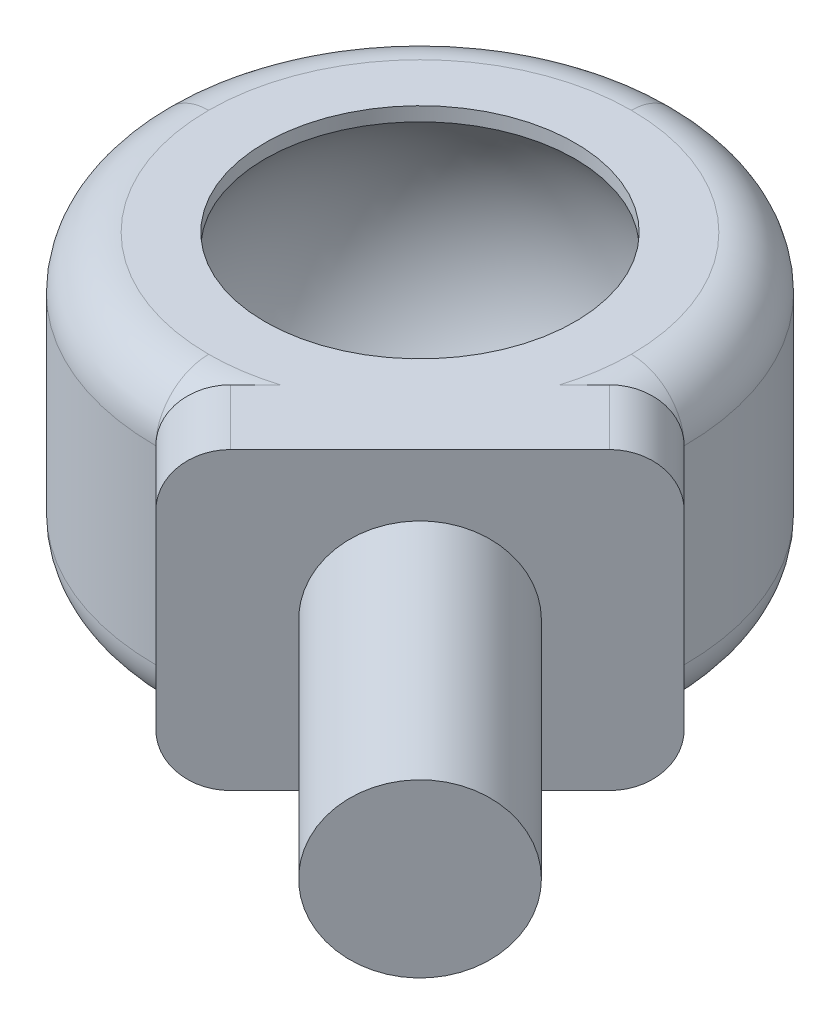
ISO-10303-21;
HEADER;
FILE_DESCRIPTION(('STEP AP214'),'2;1');
FILE_NAME('part.step','',(''),(''),'','','');
FILE_SCHEMA(('AUTOMOTIVE_DESIGN { 1 0 10303 214 1 1 1 1 }'));
ENDSEC;
DATA;
#1=APPLICATION_CONTEXT('core data for automotive mechanical design processes');
#2=APPLICATION_PROTOCOL_DEFINITION('international standard','automotive_design',2000,#1);
#3=PRODUCT_CONTEXT('',#1,'mechanical');
#4=PRODUCT('Part','Part','',(#3));
#5=PRODUCT_RELATED_PRODUCT_CATEGORY('part','',(#4));
#6=PRODUCT_DEFINITION_FORMATION('','',#4);
#7=PRODUCT_DEFINITION_CONTEXT('part definition',#1,'design');
#8=PRODUCT_DEFINITION('design','',#6,#7);
#9=PRODUCT_DEFINITION_SHAPE('','',#8);
#10=(LENGTH_UNIT() NAMED_UNIT(*) SI_UNIT(.MILLI.,.METRE.));
#11=(NAMED_UNIT(*) PLANE_ANGLE_UNIT() SI_UNIT($,.RADIAN.));
#12=(NAMED_UNIT(*) SI_UNIT($,.STERADIAN.) SOLID_ANGLE_UNIT());
#13=UNCERTAINTY_MEASURE_WITH_UNIT(LENGTH_MEASURE(1.E-05),#10,'distance_accuracy_value','');
#14=(GEOMETRIC_REPRESENTATION_CONTEXT(3) GLOBAL_UNCERTAINTY_ASSIGNED_CONTEXT((#13)) GLOBAL_UNIT_ASSIGNED_CONTEXT((#10,
#11,#12)) REPRESENTATION_CONTEXT('',''));
#15=CARTESIAN_POINT('',(0.,0.,0.));
#16=DIRECTION('',(0.,0.,1.));
#17=DIRECTION('',(1.,0.,0.));
#18=AXIS2_PLACEMENT_3D('',#15,#16,#17);
#19=CARTESIAN_POINT('',(0.,11.18,0.));
#20=DIRECTION('',(0.,1.,0.));
#21=DIRECTION('',(0.,0.,1.));
#22=AXIS2_PLACEMENT_3D('',#19,#20,#21);
#23=PLANE('',#22);
#24=CARTESIAN_POINT('',(-10.,11.18,-10.));
#25=DIRECTION('',(0.,1.,0.));
#26=DIRECTION('',(0.,0.,1.));
#27=AXIS2_PLACEMENT_3D('',#24,#25,#26);
#28=CIRCLE('',#27,5.86790461912282);
#29=CARTESIAN_POINT('',(-10.,11.18,-4.13209538087718));
#30=VERTEX_POINT('',#29);
#31=EDGE_CURVE('E324',#30,#30,#28,.F.);
#32=ORIENTED_EDGE('',*,*,#31,.T.);
#33=EDGE_LOOP('',(#32));
#34=FACE_BOUND('',#33,.T.);
#35=DIRECTION('',(-0.707106781186548,0.,-0.707106781186547));
#36=VECTOR('',#35,1.);
#37=CARTESIAN_POINT('',(2.02081528017132,11.18,9.19238815542511));
#38=LINE('',#37,#36);
#39=CARTESIAN_POINT('',(-6.46446609406725,11.18,0.707106781186535));
#40=VERTEX_POINT('',#39);
#41=CARTESIAN_POINT('',(-8.58578643762689,11.18,-1.4142135623731));
#42=VERTEX_POINT('',#41);
#43=EDGE_CURVE('E487',#40,#42,#38,.T.);
#44=ORIENTED_EDGE('',*,*,#43,.F.);
#45=DIRECTION('',(0.707106781186547,0.,-0.707106781186548));
#46=VECTOR('',#45,1.);
#47=CARTESIAN_POINT('',(-2.87867965644036,11.18,-2.87867965644036));
#48=LINE('',#47,#46);
#49=CARTESIAN_POINT('',(0.707106781186536,11.18,-6.46446609406726));
#50=VERTEX_POINT('',#49);
#51=EDGE_CURVE('E512',#40,#50,#48,.T.);
#52=ORIENTED_EDGE('',*,*,#51,.T.);
#53=DIRECTION('',(-0.707106781186548,0.,-0.707106781186547));
#54=VECTOR('',#53,1.);
#55=CARTESIAN_POINT('',(9.19238815542511,11.18,2.02081528017132));
#56=LINE('',#55,#54);
#57=CARTESIAN_POINT('',(-1.4142135623731,11.18,-8.5857864376269));
#58=VERTEX_POINT('',#57);
#59=EDGE_CURVE('E490',#50,#58,#56,.T.);
#60=ORIENTED_EDGE('',*,*,#59,.T.);
#61=DIRECTION('',(-0.707106781186547,0.,0.707106781186548));
#62=VECTOR('',#61,1.);
#63=CARTESIAN_POINT('',(-8.58578643762689,11.18,-1.4142135623731));
#64=LINE('',#63,#62);
#65=CARTESIAN_POINT('',(-2.3542486889354,11.18,-7.64575131106459));
#66=VERTEX_POINT('',#65);
#67=EDGE_CURVE('E475',#58,#66,#64,.T.);
#68=ORIENTED_EDGE('',*,*,#67,.T.);
#69=CARTESIAN_POINT('',(-10.,11.18,-9.99999999999999));
#70=DIRECTION('',(0.,1.,0.));
#71=DIRECTION('',(0.,0.,1.));
#72=AXIS2_PLACEMENT_3D('',#69,#70,#71);
#73=CIRCLE('',#72,8.);
#74=CARTESIAN_POINT('',(-2.,11.18,-10.));
#75=VERTEX_POINT('',#74);
#76=EDGE_CURVE('E67',#66,#75,#73,.T.);
#77=ORIENTED_EDGE('',*,*,#76,.T.);
#78=CARTESIAN_POINT('',(-10.,11.18,-10.));
#79=DIRECTION('',(0.,1.,0.));
#80=DIRECTION('',(0.,0.,1.));
#81=AXIS2_PLACEMENT_3D('',#78,#79,#80);
#82=CIRCLE('',#81,8.);
#83=CARTESIAN_POINT('',(-10.,11.18,-18.));
#84=VERTEX_POINT('',#83);
#85=EDGE_CURVE('E405',#75,#84,#82,.T.);
#86=ORIENTED_EDGE('',*,*,#85,.T.);
#87=CARTESIAN_POINT('',(-10.,11.18,-10.));
#88=DIRECTION('',(0.,1.,0.));
#89=DIRECTION('',(0.,0.,1.));
#90=AXIS2_PLACEMENT_3D('',#87,#88,#89);
#91=CIRCLE('',#90,8.);
#92=CARTESIAN_POINT('',(-18.,11.18,-10.));
#93=VERTEX_POINT('',#92);
#94=EDGE_CURVE('E303',#84,#93,#91,.T.);
#95=ORIENTED_EDGE('',*,*,#94,.T.);
#96=CARTESIAN_POINT('',(-10.,11.18,-10.));
#97=DIRECTION('',(0.,1.,0.));
#98=DIRECTION('',(0.,0.,1.));
#99=AXIS2_PLACEMENT_3D('',#96,#97,#98);
#100=CIRCLE('',#99,8.);
#101=CARTESIAN_POINT('',(-10.,11.18,-2.));
#102=VERTEX_POINT('',#101);
#103=EDGE_CURVE('E398',#93,#102,#100,.T.);
#104=ORIENTED_EDGE('',*,*,#103,.T.);
#105=CARTESIAN_POINT('',(-7.64575131106455,11.18,-2.35424868893545));
#106=VERTEX_POINT('',#105);
#107=EDGE_CURVE('E401',#102,#106,#73,.T.);
#108=ORIENTED_EDGE('',*,*,#107,.T.);
#109=EDGE_CURVE('E446',#106,#42,#64,.T.);
#110=ORIENTED_EDGE('',*,*,#109,.T.);
#111=EDGE_LOOP('',(#44,#52,#60,#68,#77,#86,#95,#104,#108,#110));
#112=FACE_BOUND('',#111,.T.);
#113=ADVANCED_FACE('F42',(#34,#112),#23,.T.);
#114=CARTESIAN_POINT('',(0.,0.,0.));
#115=DIRECTION('',(0.,1.,0.));
#116=DIRECTION('',(0.,0.,1.));
#117=AXIS2_PLACEMENT_3D('',#114,#115,#116);
#118=PLANE('',#117);
#119=CARTESIAN_POINT('',(-10.,0.,-10.));
#120=DIRECTION('',(0.,1.,0.));
#121=DIRECTION('',(0.,0.,1.));
#122=AXIS2_PLACEMENT_3D('',#119,#120,#121);
#123=CIRCLE('',#122,5.72153062105366);
#124=CARTESIAN_POINT('',(-10.,0.,-4.27846937894634));
#125=VERTEX_POINT('',#124);
#126=EDGE_CURVE('E52',#125,#125,#123,.T.);
#127=ORIENTED_EDGE('',*,*,#126,.T.);
#128=EDGE_LOOP('',(#127));
#129=FACE_BOUND('',#128,.T.);
#130=DIRECTION('',(0.707106781186547,0.,-0.707106781186548));
#131=VECTOR('',#130,1.);
#132=CARTESIAN_POINT('',(-2.87867965644036,0.,-2.87867965644036));
#133=LINE('',#132,#131);
#134=CARTESIAN_POINT('',(-6.46446609406725,0.,0.707106781186533));
#135=VERTEX_POINT('',#134);
#136=CARTESIAN_POINT('',(0.707106781186536,0.,-6.46446609406726));
#137=VERTEX_POINT('',#136);
#138=EDGE_CURVE('E160',#135,#137,#133,.T.);
#139=ORIENTED_EDGE('',*,*,#138,.F.);
#140=DIRECTION('',(-0.707106781186548,0.,-0.707106781186547));
#141=VECTOR('',#140,1.);
#142=CARTESIAN_POINT('',(2.02081528017132,0.,9.19238815542511));
#143=LINE('',#142,#141);
#144=CARTESIAN_POINT('',(-8.58578643762689,0.,-1.41421356237311));
#145=VERTEX_POINT('',#144);
#146=EDGE_CURVE('E173',#135,#145,#143,.T.);
#147=ORIENTED_EDGE('',*,*,#146,.T.);
#148=DIRECTION('',(0.707106781186547,0.,-0.707106781186547));
#149=VECTOR('',#148,1.);
#150=CARTESIAN_POINT('',(-8.58578643762689,0.,-1.41421356237311));
#151=LINE('',#150,#149);
#152=CARTESIAN_POINT('',(-7.64575131106459,0.,-2.3542486889354));
#153=VERTEX_POINT('',#152);
#154=EDGE_CURVE('E458',#145,#153,#151,.T.);
#155=ORIENTED_EDGE('',*,*,#154,.T.);
#156=CARTESIAN_POINT('',(-10.,0.,-9.99999999999999));
#157=DIRECTION('',(0.,1.,0.));
#158=DIRECTION('',(0.,0.,1.));
#159=AXIS2_PLACEMENT_3D('',#156,#157,#158);
#160=CIRCLE('',#159,8.);
#161=CARTESIAN_POINT('',(-10.,0.,-2.));
#162=VERTEX_POINT('',#161);
#163=EDGE_CURVE('E373',#153,#162,#160,.F.);
#164=ORIENTED_EDGE('',*,*,#163,.T.);
#165=CARTESIAN_POINT('',(-10.,0.,-10.));
#166=DIRECTION('',(0.,1.,0.));
#167=DIRECTION('',(0.,0.,1.));
#168=AXIS2_PLACEMENT_3D('',#165,#166,#167);
#169=CIRCLE('',#168,8.);
#170=CARTESIAN_POINT('',(-18.,0.,-10.));
#171=VERTEX_POINT('',#170);
#172=EDGE_CURVE('E378',#162,#171,#169,.F.);
#173=ORIENTED_EDGE('',*,*,#172,.T.);
#174=CARTESIAN_POINT('',(-10.,0.,-10.));
#175=DIRECTION('',(0.,1.,0.));
#176=DIRECTION('',(0.,0.,1.));
#177=AXIS2_PLACEMENT_3D('',#174,#175,#176);
#178=CIRCLE('',#177,8.);
#179=CARTESIAN_POINT('',(-10.,0.,-18.));
#180=VERTEX_POINT('',#179);
#181=EDGE_CURVE('E367',#171,#180,#178,.F.);
#182=ORIENTED_EDGE('',*,*,#181,.T.);
#183=CARTESIAN_POINT('',(-10.,0.,-10.));
#184=DIRECTION('',(0.,1.,0.));
#185=DIRECTION('',(0.,0.,1.));
#186=AXIS2_PLACEMENT_3D('',#183,#184,#185);
#187=CIRCLE('',#186,8.);
#188=CARTESIAN_POINT('',(-2.,0.,-10.));
#189=VERTEX_POINT('',#188);
#190=EDGE_CURVE('E370',#180,#189,#187,.F.);
#191=ORIENTED_EDGE('',*,*,#190,.T.);
#192=CARTESIAN_POINT('',(-2.35424868893545,0.,-7.64575131106455));
#193=VERTEX_POINT('',#192);
#194=EDGE_CURVE('E374',#189,#193,#160,.F.);
#195=ORIENTED_EDGE('',*,*,#194,.T.);
#196=CARTESIAN_POINT('',(-1.4142135623731,0.,-8.5857864376269));
#197=VERTEX_POINT('',#196);
#198=EDGE_CURVE('E462',#193,#197,#151,.T.);
#199=ORIENTED_EDGE('',*,*,#198,.T.);
#200=DIRECTION('',(-0.707106781186548,0.,-0.707106781186547));
#201=VECTOR('',#200,1.);
#202=CARTESIAN_POINT('',(9.19238815542511,0.,2.02081528017131));
#203=LINE('',#202,#201);
#204=EDGE_CURVE('E176',#137,#197,#203,.T.);
#205=ORIENTED_EDGE('',*,*,#204,.F.);
#206=EDGE_LOOP('',(#139,#147,#155,#164,#173,#182,#191,#195,#199,#205));
#207=FACE_BOUND('',#206,.T.);
#208=ADVANCED_FACE('F171',(#129,#207),#118,.F.);
#209=CARTESIAN_POINT('',(0.606601717798218,9.17999999999999,10.6066017177982));
#210=DIRECTION('',(0.707106781186547,0.,-0.707106781186548));
#211=DIRECTION('',(-0.707106781186548,0.,-0.707106781186547));
#212=AXIS2_PLACEMENT_3D('',#209,#210,#211);
#213=PLANE('',#212);
#214=DIRECTION('',(0.,-1.,0.));
#215=VECTOR('',#214,1.);
#216=CARTESIAN_POINT('',(-7.87867965644036,9.17999999999999,2.12132034355964));
#217=LINE('',#216,#215);
#218=CARTESIAN_POINT('',(-7.87867965644036,9.17999999999999,2.12132034355964));
#219=VERTEX_POINT('',#218);
#220=CARTESIAN_POINT('',(-7.87867965644035,2.00000000000001,2.12132034355964));
#221=VERTEX_POINT('',#220);
#222=EDGE_CURVE('E59',#219,#221,#217,.T.);
#223=ORIENTED_EDGE('',*,*,#222,.F.);
#224=DIRECTION('',(-0.707106781186548,0.,-0.707106781186547));
#225=VECTOR('',#224,1.);
#226=CARTESIAN_POINT('',(0.606601717798218,9.17999999999999,10.6066017177982));
#227=LINE('',#226,#225);
#228=CARTESIAN_POINT('',(-10.,9.17999999999999,0.));
#229=VERTEX_POINT('',#228);
#230=EDGE_CURVE('E484',#219,#229,#227,.T.);
#231=ORIENTED_EDGE('',*,*,#230,.T.);
#232=DIRECTION('',(0.,-1.,0.));
#233=VECTOR('',#232,1.);
#234=CARTESIAN_POINT('',(-10.,11.18,0.));
#235=LINE('',#234,#233);
#236=CARTESIAN_POINT('',(-9.99999999999999,2.00000000000001,0.));
#237=VERTEX_POINT('',#236);
#238=EDGE_CURVE('E350',#237,#229,#235,.F.);
#239=ORIENTED_EDGE('',*,*,#238,.F.);
#240=DIRECTION('',(-0.707106781186548,0.,-0.707106781186547));
#241=VECTOR('',#240,1.);
#242=CARTESIAN_POINT('',(0.60660171779822,2.00000000000001,10.6066017177982));
#243=LINE('',#242,#241);
#244=EDGE_CURVE('E481',#221,#237,#243,.T.);
#245=ORIENTED_EDGE('',*,*,#244,.F.);
#246=EDGE_LOOP('',(#223,#231,#239,#245));
#247=FACE_BOUND('',#246,.T.);
#248=ADVANCED_FACE('F224',(#247),#213,.F.);
#249=CARTESIAN_POINT('',(2.02081528017131,9.18,9.19238815542512));
#250=DIRECTION('',(-0.707106781186548,0.,-0.707106781186547));
#251=DIRECTION('',(-0.707106781186547,0.,0.707106781186548));
#252=AXIS2_PLACEMENT_3D('',#249,#250,#251);
#253=CYLINDRICAL_SURFACE('',#252,2.);
#254=CARTESIAN_POINT('',(-6.46446609406726,9.18,0.707106781186545));
#255=DIRECTION('',(0.707106781186548,0.,0.707106781186547));
#256=DIRECTION('',(0.707106781186547,0.,-0.707106781186548));
#257=AXIS2_PLACEMENT_3D('',#254,#255,#256);
#258=CIRCLE('',#257,2.);
#259=EDGE_CURVE('E516',#40,#219,#258,.T.);
#260=ORIENTED_EDGE('',*,*,#259,.F.);
#261=ORIENTED_EDGE('',*,*,#43,.T.);
#262=CARTESIAN_POINT('',(-8.5857864376269,9.18,-1.41421356237309));
#263=DIRECTION('',(0.707106781186548,0.,0.707106781186547));
#264=DIRECTION('',(0.707106781186547,0.,-0.707106781186548));
#265=AXIS2_PLACEMENT_3D('',#262,#263,#264);
#266=CIRCLE('',#265,2.);
#267=EDGE_CURVE('E478',#42,#229,#266,.T.);
#268=ORIENTED_EDGE('',*,*,#267,.T.);
#269=ORIENTED_EDGE('',*,*,#230,.F.);
#270=EDGE_LOOP('',(#260,#261,#268,#269));
#271=FACE_BOUND('',#270,.T.);
#272=ADVANCED_FACE('F228',(#271),#253,.T.);
#273=CARTESIAN_POINT('',(9.19238815542512,9.18,2.02081528017131));
#274=DIRECTION('',(-0.707106781186548,0.,-0.707106781186547));
#275=DIRECTION('',(-0.707106781186547,0.,0.707106781186548));
#276=AXIS2_PLACEMENT_3D('',#273,#274,#275);
#277=CYLINDRICAL_SURFACE('',#276,2.);
#278=CARTESIAN_POINT('',(0.707106781186547,9.18,-6.46446609406727));
#279=DIRECTION('',(0.707106781186548,0.,0.707106781186547));
#280=DIRECTION('',(0.707106781186547,0.,-0.707106781186548));
#281=AXIS2_PLACEMENT_3D('',#278,#279,#280);
#282=CIRCLE('',#281,2.);
#283=CARTESIAN_POINT('',(2.12132034355964,9.17999999999999,-7.87867965644036));
#284=VERTEX_POINT('',#283);
#285=EDGE_CURVE('E514',#284,#50,#282,.T.);
#286=ORIENTED_EDGE('',*,*,#285,.F.);
#287=DIRECTION('',(-0.707106781186548,0.,-0.707106781186547));
#288=VECTOR('',#287,1.);
#289=CARTESIAN_POINT('',(10.6066017177982,9.17999999999999,0.60660171779821));
#290=LINE('',#289,#288);
#291=CARTESIAN_POINT('',(0.,9.18,-10.));
#292=VERTEX_POINT('',#291);
#293=EDGE_CURVE('E493',#284,#292,#290,.T.);
#294=ORIENTED_EDGE('',*,*,#293,.T.);
#295=CARTESIAN_POINT('',(-1.41421356237309,9.18,-8.5857864376269));
#296=DIRECTION('',(0.707106781186548,0.,0.707106781186547));
#297=DIRECTION('',(-0.707106781186547,0.,0.707106781186548));
#298=AXIS2_PLACEMENT_3D('',#295,#296,#297);
#299=CIRCLE('',#298,2.);
#300=EDGE_CURVE('E467',#292,#58,#299,.T.);
#301=ORIENTED_EDGE('',*,*,#300,.T.);
#302=ORIENTED_EDGE('',*,*,#59,.F.);
#303=EDGE_LOOP('',(#286,#294,#301,#302));
#304=FACE_BOUND('',#303,.T.);
#305=ADVANCED_FACE('F232',(#304),#277,.T.);
#306=CARTESIAN_POINT('',(10.6066017177982,9.17999999999999,0.60660171779821));
#307=DIRECTION('',(-0.707106781186547,0.,0.707106781186548));
#308=DIRECTION('',(0.707106781186548,0.,0.707106781186547));
#309=AXIS2_PLACEMENT_3D('',#306,#307,#308);
#310=PLANE('',#309);
#311=DIRECTION('',(0.,1.,0.));
#312=VECTOR('',#311,1.);
#313=CARTESIAN_POINT('',(2.12132034355964,9.17999999999999,-7.87867965644036));
#314=LINE('',#313,#312);
#315=CARTESIAN_POINT('',(2.12132034355964,2.00000000000001,-7.87867965644036));
#316=VERTEX_POINT('',#315);
#317=EDGE_CURVE('E500',#316,#284,#314,.T.);
#318=ORIENTED_EDGE('',*,*,#317,.F.);
#319=DIRECTION('',(-0.707106781186548,0.,-0.707106781186547));
#320=VECTOR('',#319,1.);
#321=CARTESIAN_POINT('',(10.6066017177982,2.00000000000001,0.606601717798208));
#322=LINE('',#321,#320);
#323=CARTESIAN_POINT('',(0.,2.00000000000001,-10.));
#324=VERTEX_POINT('',#323);
#325=EDGE_CURVE('E192',#316,#324,#322,.T.);
#326=ORIENTED_EDGE('',*,*,#325,.T.);
#327=DIRECTION('',(0.,-1.,0.));
#328=VECTOR('',#327,1.);
#329=CARTESIAN_POINT('',(0.,11.18,-10.));
#330=LINE('',#329,#328);
#331=EDGE_CURVE('E359',#324,#292,#330,.F.);
#332=ORIENTED_EDGE('',*,*,#331,.T.);
#333=ORIENTED_EDGE('',*,*,#293,.F.);
#334=EDGE_LOOP('',(#318,#326,#332,#333));
#335=FACE_BOUND('',#334,.T.);
#336=ADVANCED_FACE('F236',(#335),#310,.F.);
#337=CARTESIAN_POINT('',(9.19238815542512,2.,2.0208152801713));
#338=DIRECTION('',(-0.707106781186548,0.,-0.707106781186547));
#339=DIRECTION('',(-0.707106781186547,0.,0.707106781186548));
#340=AXIS2_PLACEMENT_3D('',#337,#338,#339);
#341=CYLINDRICAL_SURFACE('',#340,2.);
#342=CARTESIAN_POINT('',(0.707106781186547,2.,-6.46446609406727));
#343=DIRECTION('',(0.707106781186548,0.,0.707106781186547));
#344=DIRECTION('',(0.707106781186547,0.,-0.707106781186548));
#345=AXIS2_PLACEMENT_3D('',#342,#343,#344);
#346=CIRCLE('',#345,2.);
#347=EDGE_CURVE('E178',#137,#316,#346,.T.);
#348=ORIENTED_EDGE('',*,*,#347,.F.);
#349=ORIENTED_EDGE('',*,*,#204,.T.);
#350=CARTESIAN_POINT('',(-1.41421356237309,2.,-8.58578643762691));
#351=DIRECTION('',(0.707106781186548,0.,0.707106781186547));
#352=DIRECTION('',(0.707106781186547,0.,-0.707106781186548));
#353=AXIS2_PLACEMENT_3D('',#350,#351,#352);
#354=CIRCLE('',#353,2.);
#355=EDGE_CURVE('E461',#197,#324,#354,.T.);
#356=ORIENTED_EDGE('',*,*,#355,.T.);
#357=ORIENTED_EDGE('',*,*,#325,.F.);
#358=EDGE_LOOP('',(#348,#349,#356,#357));
#359=FACE_BOUND('',#358,.T.);
#360=ADVANCED_FACE('F240',(#359),#341,.T.);
#361=CARTESIAN_POINT('',(2.02081528017131,2.,9.19238815542511));
#362=DIRECTION('',(-0.707106781186548,0.,-0.707106781186547));
#363=DIRECTION('',(-0.707106781186547,0.,0.707106781186548));
#364=AXIS2_PLACEMENT_3D('',#361,#362,#363);
#365=CYLINDRICAL_SURFACE('',#364,2.);
#366=CARTESIAN_POINT('',(-6.46446609406726,2.,0.707106781186543));
#367=DIRECTION('',(0.707106781186548,0.,0.707106781186547));
#368=DIRECTION('',(0.707106781186547,0.,-0.707106781186548));
#369=AXIS2_PLACEMENT_3D('',#366,#367,#368);
#370=CIRCLE('',#369,2.);
#371=EDGE_CURVE('E156',#221,#135,#370,.T.);
#372=ORIENTED_EDGE('',*,*,#371,.F.);
#373=ORIENTED_EDGE('',*,*,#244,.T.);
#374=CARTESIAN_POINT('',(-8.5857864376269,2.,-1.41421356237309));
#375=DIRECTION('',(0.707106781186548,0.,0.707106781186547));
#376=DIRECTION('',(0.707106781186547,0.,-0.707106781186548));
#377=AXIS2_PLACEMENT_3D('',#374,#375,#376);
#378=CIRCLE('',#377,2.);
#379=EDGE_CURVE('E183',#237,#145,#378,.T.);
#380=ORIENTED_EDGE('',*,*,#379,.T.);
#381=ORIENTED_EDGE('',*,*,#146,.F.);
#382=EDGE_LOOP('',(#372,#373,#380,#381));
#383=FACE_BOUND('',#382,.T.);
#384=ADVANCED_FACE('F181',(#383),#365,.T.);
#385=CARTESIAN_POINT('',(-10.,5.59,-10.));
#386=DIRECTION('',(0.,1.,0.));
#387=DIRECTION('',(1.,0.,0.));
#388=AXIS2_PLACEMENT_3D('',#385,#386,#387);
#389=SPHERICAL_SURFACE('',#388,7.75);
#390=CARTESIAN_POINT('',(-10.,0.370752664039414,-10.));
#391=DIRECTION('',(0.,1.,0.));
#392=DIRECTION('',(0.,0.,1.));
#393=AXIS2_PLACEMENT_3D('',#390,#391,#392);
#394=CIRCLE('',#393,5.72904505533587);
#395=CARTESIAN_POINT('',(-10.,0.370752664039414,-4.27095494466413));
#396=VERTEX_POINT('',#395);
#397=EDGE_CURVE('E12',#396,#396,#394,.F.);
#398=ORIENTED_EDGE('',*,*,#397,.T.);
#399=EDGE_LOOP('',(#398));
#400=FACE_BOUND('',#399,.T.);
#401=CARTESIAN_POINT('',(-10.,10.6526273199671,-10.));
#402=DIRECTION('',(0.,-1.,0.));
#403=DIRECTION('',(0.,0.,-1.));
#404=AXIS2_PLACEMENT_3D('',#401,#402,#403);
#405=CIRCLE('',#404,5.86790461912282);
#406=CARTESIAN_POINT('',(-10.,10.6526273199671,-15.8679046191228));
#407=VERTEX_POINT('',#406);
#408=EDGE_CURVE('E166',#407,#407,#405,.F.);
#409=ORIENTED_EDGE('',*,*,#408,.T.);
#410=EDGE_LOOP('',(#409));
#411=FACE_BOUND('',#410,.T.);
#412=CARTESIAN_POINT('',(-5.,5.59,-5.));
#413=DIRECTION('',(0.707106781186548,0.,0.707106781186547));
#414=DIRECTION('',(0.707106781186547,0.,-0.707106781186548));
#415=AXIS2_PLACEMENT_3D('',#412,#413,#414);
#416=CIRCLE('',#415,3.17214438511237);
#417=CARTESIAN_POINT('',(-2.75695519438421,5.59,-7.24304480561579));
#418=VERTEX_POINT('',#417);
#419=EDGE_CURVE('E167',#418,#418,#416,.F.);
#420=ORIENTED_EDGE('',*,*,#419,.F.);
#421=EDGE_LOOP('',(#420));
#422=FACE_BOUND('',#421,.T.);
#423=ADVANCED_FACE('F247',(#400,#411,#422),#389,.F.);
#424=CARTESIAN_POINT('',(-10.,2.,-9.99999999999999));
#425=DIRECTION('',(0.,1.,0.));
#426=DIRECTION('',(0.,0.,1.));
#427=AXIS2_PLACEMENT_3D('',#424,#425,#426);
#428=TOROIDAL_SURFACE('',#427,8.,2.);
#429=CARTESIAN_POINT('',(-2.,2.,-10.));
#430=DIRECTION('',(0.,0.,1.));
#431=DIRECTION('',(1.,0.,0.));
#432=AXIS2_PLACEMENT_3D('',#429,#430,#431);
#433=CIRCLE('',#432,2.);
#434=EDGE_CURVE('E355',#189,#324,#433,.T.);
#435=ORIENTED_EDGE('',*,*,#434,.T.);
#436=CARTESIAN_POINT('',(-9.99999864550834E-09,2.0002,-9.99999999));
#437=CARTESIAN_POINT('',(1.35876293541496E-05,1.95617604723512,-10.0000135876294));
#438=CARTESIAN_POINT('',(-0.00144448743844491,1.912158629628,-9.99855551256156));
#439=CARTESIAN_POINT('',(-0.00723343972806273,1.8245295947836,-9.99276656027194));
#440=CARTESIAN_POINT('',(-0.0115625494887681,1.7809177446109,-9.98843745051123));
#441=CARTESIAN_POINT('',(-0.022983700444081,1.69473543897273,-9.97701629955592));
#442=CARTESIAN_POINT('',(-0.0300564999948179,1.65215987871648,-9.96994350000518));
#443=CARTESIAN_POINT('',(-0.0468336272322785,1.56806788230342,-9.95316637276772));
#444=CARTESIAN_POINT('',(-0.0565382281191772,1.52655155659266,-9.94346177188082));
#445=CARTESIAN_POINT('',(-0.0893266204977646,1.40420475910627,-9.91067337950224));
#446=CARTESIAN_POINT('',(-0.116121825163525,1.32530839397202,-9.88387817483648));
#447=CARTESIAN_POINT('',(-0.178088077569696,1.1744123292075,-9.8219119224303));
#448=CARTESIAN_POINT('',(-0.213270917562943,1.10242254125315,-9.78672908243706));
#449=CARTESIAN_POINT('',(-0.304081613731342,0.942055708601814,-9.69591838626866));
#450=CARTESIAN_POINT('',(-0.362540248782041,0.856881832943041,-9.63745975121796));
#451=CARTESIAN_POINT('',(-0.488448612210587,0.700918217504364,-9.51155138778942));
#452=CARTESIAN_POINT('',(-0.555923713936667,0.630170548421676,-9.44407628606333));
#453=CARTESIAN_POINT('',(-0.728918305080135,0.473514244004685,-9.27108169491986));
#454=CARTESIAN_POINT('',(-0.837854355939517,0.395194269586728,-9.16214564406048));
#455=CARTESIAN_POINT('',(-1.06249633867031,0.263579860474087,-8.93750366132969));
#456=CARTESIAN_POINT('',(-1.17819104278629,0.210245178093635,-8.82180895721371));
#457=CARTESIAN_POINT('',(-1.39866055434581,0.129223156936546,-8.60133944565419));
#458=CARTESIAN_POINT('',(-1.50301937379274,0.0991818517150003,-8.49698062620726));
#459=CARTESIAN_POINT('',(-1.71319975380686,0.051957015300888,-8.28680024619314));
#460=CARTESIAN_POINT('',(-1.81902223530653,0.0347819928851252,-8.18097776469347));
#461=CARTESIAN_POINT('',(-2.0321605929992,0.0107297838745102,-7.9678394070008));
#462=CARTESIAN_POINT('',(-2.13948138382836,0.00394545509194764,-7.86051861617164));
#463=CARTESIAN_POINT('',(-2.30050839460854,-1.91302246704608E-05,-7.69949160539146));
#464=CARTESIAN_POINT('',(-2.35419325296355,-0.000305259261873984,-7.64580674703645));
#465=CARTESIAN_POINT('',(-2.46154139026899,0.000924242582143714,-7.53845860973101));
#466=CARTESIAN_POINT('',(-2.51520467135802,0.00243946879964483,-7.48479532864198));
#467=CARTESIAN_POINT('',(-2.69439890916773,0.0100675138301232,-7.30560109083227));
#468=CARTESIAN_POINT('',(-2.81985465413597,0.0196205164039135,-7.18014534586403));
#469=CARTESIAN_POINT('',(-3.0705158652954,0.0439316228545487,-6.9294841347046));
#470=CARTESIAN_POINT('',(-3.19572125887173,0.058691063926766,-6.80427874112827));
#471=CARTESIAN_POINT('',(-3.44614553638878,0.0903594207135211,-6.55385446361122));
#472=CARTESIAN_POINT('',(-3.57136424618932,0.107270967334204,-6.42863575381068));
#473=CARTESIAN_POINT('',(-3.82183891632162,0.140253935990191,-6.17816108367838));
#474=CARTESIAN_POINT('',(-3.94709486715048,0.156325495627164,-6.05290513284952));
#475=CARTESIAN_POINT('',(-4.19818072860967,0.184937251255486,-5.80181927139033));
#476=CARTESIAN_POINT('',(-4.3240112568746,0.19746723276186,-5.6759887431254));
#477=CARTESIAN_POINT('',(-4.57589721966931,0.216716941758062,-5.42410278033068));
#478=CARTESIAN_POINT('',(-4.70195263361726,0.223437176117597,-5.29804736638274));
#479=CARTESIAN_POINT('',(-4.95394736445532,0.229821988129759,-5.04605263554468));
#480=CARTESIAN_POINT('',(-5.07988652203767,0.229498367589892,-4.92011347796233));
#481=CARTESIAN_POINT('',(-5.33165860121545,0.22188525067088,-4.66834139878455));
#482=CARTESIAN_POINT('',(-5.45749151724692,0.214595409675949,-4.54250848275308));
#483=CARTESIAN_POINT('',(-5.70639454253943,0.194590445341278,-4.29360545746057));
#484=CARTESIAN_POINT('',(-5.82946940124486,0.181987178706442,-4.17053059875513));
#485=CARTESIAN_POINT('',(-6.07542458157399,0.153511721066612,-3.92457541842601));
#486=CARTESIAN_POINT('',(-6.19830488572637,0.137639251589978,-3.80169511427363));
#487=CARTESIAN_POINT('',(-6.5677341422916,0.0888698173581522,-3.4322658577084));
#488=CARTESIAN_POINT('',(-6.81423855230277,0.0549212951970129,-3.18576144769723));
#489=CARTESIAN_POINT('',(-7.18337629008072,0.0194034616743266,-2.81662370991928));
#490=CARTESIAN_POINT('',(-7.30559330120402,0.0101420163853393,-2.69440669879597));
#491=CARTESIAN_POINT('',(-7.55027990112054,-0.00042040595806344,-2.44972009887946));
#492=CARTESIAN_POINT('',(-7.67274956951588,-0.00171829290467144,-2.32725043048412));
#493=CARTESIAN_POINT('',(-7.9169321285045,0.00679752710550863,-2.08306787149549));
#494=CARTESIAN_POINT('',(-8.03864577961047,0.0165566389555681,-1.96135422038953));
#495=CARTESIAN_POINT('',(-8.2810233523145,0.0505286428908976,-1.71897664768549));
#496=CARTESIAN_POINT('',(-8.40168839902237,0.0747233917565454,-1.59831160097762));
#497=CARTESIAN_POINT('',(-8.56851402957354,0.121285531613374,-1.43148597042646));
#498=CARTESIAN_POINT('',(-8.61576462540607,0.135972309278757,-1.38423537459393));
#499=CARTESIAN_POINT('',(-8.70979705599796,0.16852235172386,-1.29020294400204));
#500=CARTESIAN_POINT('',(-8.75657807199915,0.186390395859924,-1.24342192800085));
#501=CARTESIAN_POINT('',(-8.84938286819474,0.225541911111519,-1.15061713180526));
#502=CARTESIAN_POINT('',(-8.89540726277911,0.246822443115326,-1.10459273722088));
#503=CARTESIAN_POINT('',(-8.98649356935854,0.293073241959722,-1.01350643064146));
#504=CARTESIAN_POINT('',(-9.03155585629063,0.318042040280068,-0.968444143709366));
#505=CARTESIAN_POINT('',(-9.16568128353431,0.399360344972485,-0.834318716465689));
#506=CARTESIAN_POINT('',(-9.25296295393608,0.461830452216678,-0.747037046063917));
#507=CARTESIAN_POINT('',(-9.41978920924895,0.605193787667716,-0.580210790751043));
#508=CARTESIAN_POINT('',(-9.49933586425211,0.686082067218336,-0.500664135747881));
#509=CARTESIAN_POINT('',(-9.62631138074178,0.842863843104809,-0.373688619258214));
#510=CARTESIAN_POINT('',(-9.67658739837986,0.914118551771943,-0.323412601620131));
#511=CARTESIAN_POINT('',(-9.76860357267633,1.06695325626934,-0.231396427323663));
#512=CARTESIAN_POINT('',(-9.81034968910786,1.14852597802387,-0.18965031089214));
#513=CARTESIAN_POINT('',(-9.88332747238115,1.32204750783841,-0.116672527618849));
#514=CARTESIAN_POINT('',(-9.91443838511592,1.41410061548412,-0.0855616148840782));
#515=CARTESIAN_POINT('',(-9.95087084060544,1.55717496717511,-0.0491291593945583));
#516=CARTESIAN_POINT('',(-9.96130680115489,1.605674569567,-0.0386931988451093));
#517=CARTESIAN_POINT('',(-9.97857129240255,1.70392959834052,-0.0214287075974456));
#518=CARTESIAN_POINT('',(-9.98540261139238,1.75368402277263,-0.0145973886076135));
#519=CARTESIAN_POINT('',(-9.99356000796471,1.83634237623364,-0.00643999203528792));
#520=CARTESIAN_POINT('',(-9.9959764693478,1.86903940763525,-0.0040235306521997));
#521=CARTESIAN_POINT('',(-9.99919816177606,1.93455533652052,-0.000801838223930529));
#522=CARTESIAN_POINT('',(-10.0000051705523,1.96737405938538,5.17055228107624E-06));
#523=CARTESIAN_POINT('',(-9.99999999,2.0002,-9.99999543007705E-09));
#524=B_SPLINE_CURVE_WITH_KNOTS('',3,(#436,#437,#438,#439,#440,#441,#442,#443,#444,#445,#446,
#447,#448,#449,#450,#451,#452,#453,#454,#455,#456,#457,#458,#459,#460,#461,#462,#463,#464,#465,
#466,#467,#468,#469,#470,#471,#472,#473,#474,#475,#476,#477,#478,#479,#480,#481,#482,#483,#484,
#485,#486,#487,#488,#489,#490,#491,#492,#493,#494,#495,#496,#497,#498,#499,#500,#501,#502,#503,
#504,#505,#506,#507,#508,#509,#510,#511,#512,#513,#514,#515,#516,#517,#518,#519,#520,#521,#522,
#523),.UNSPECIFIED.,.F.,.F.,(4,2,2,2,2,2,2,2,2,2,2,2,2,2,2,2,2,2,2,2,2,2,2,2,2,2,2,2,2,2,2,2,2,
2,2,2,2,2,2,2,2,2,2,4),(0.,0.132012113707138,0.263943033704565,0.394964971427778,
0.526000515393491,0.787263386037747,1.04889575745278,1.40301561504677,1.75815385986198,
2.27372274904842,2.78845825116683,3.23962419033559,3.69108823344103,4.14656377681519,
4.37431470031268,4.60201447058915,5.13489556051093,5.66791361268837,6.20158964360081,
6.73517797509634,7.27028991365735,7.80535516181941,8.33952399029095,8.87371924522177,
9.3971899404473,9.92070524351162,10.9712829754585,11.4904266790223,12.0097718137232,
12.5265637599023,13.0427075478642,13.2478982876197,13.4533999364085,13.6587255318483,
13.8639695941091,14.2776143477038,14.6911480927109,14.9920636780638,15.2927682917224,
15.5967818102744,15.748643921139,15.9003883895448,15.9989409275261,16.0973845482564),.UNSPECIFIED.);
#525=EDGE_CURVE('E423',#324,#193,#524,.T.);
#526=ORIENTED_EDGE('',*,*,#525,.T.);
#527=ORIENTED_EDGE('',*,*,#194,.F.);
#528=EDGE_LOOP('',(#435,#526,#527));
#529=FACE_BOUND('',#528,.T.);
#530=ADVANCED_FACE('F250',(#529),#428,.T.);
#531=ORIENTED_EDGE('',*,*,#163,.F.);
#532=EDGE_CURVE('E202',#153,#237,#524,.T.);
#533=ORIENTED_EDGE('',*,*,#532,.T.);
#534=CARTESIAN_POINT('',(-10.,2.,-2.));
#535=DIRECTION('',(-1.,0.,0.));
#536=DIRECTION('',(0.,0.,1.));
#537=AXIS2_PLACEMENT_3D('',#534,#535,#536);
#538=CIRCLE('',#537,2.);
#539=EDGE_CURVE('E412',#162,#237,#538,.T.);
#540=ORIENTED_EDGE('',*,*,#539,.F.);
#541=EDGE_LOOP('',(#531,#533,#540));
#542=FACE_BOUND('',#541,.T.);
#543=ADVANCED_FACE('F283',(#542),#428,.T.);
#544=CARTESIAN_POINT('',(-10.,9.18,-9.99999999999999));
#545=DIRECTION('',(0.,1.,0.));
#546=DIRECTION('',(0.,0.,1.));
#547=AXIS2_PLACEMENT_3D('',#544,#545,#546);
#548=TOROIDAL_SURFACE('',#547,8.,2.);
#549=CARTESIAN_POINT('',(-10.,9.18,-2.));
#550=DIRECTION('',(1.,0.,0.));
#551=DIRECTION('',(0.,0.,-1.));
#552=AXIS2_PLACEMENT_3D('',#549,#550,#551);
#553=CIRCLE('',#552,2.);
#554=EDGE_CURVE('E308',#102,#229,#553,.T.);
#555=ORIENTED_EDGE('',*,*,#554,.T.);
#556=CARTESIAN_POINT('',(-9.99999999,9.1798,-9.99999479151174E-09));
#557=CARTESIAN_POINT('',(-10.0000135876294,9.22382395276487,1.35876293586947E-05));
#558=CARTESIAN_POINT('',(-9.99855551256156,9.267841370372,-0.00144448743844071));
#559=CARTESIAN_POINT('',(-9.99276656027194,9.3554704052164,-0.00723343972805957));
#560=CARTESIAN_POINT('',(-9.98843745051123,9.39908225538909,-0.0115625494887657));
#561=CARTESIAN_POINT('',(-9.97701629955592,9.48526456102727,-0.0229837004440787));
#562=CARTESIAN_POINT('',(-9.96994350000518,9.52784012128352,-0.030056499994815));
#563=CARTESIAN_POINT('',(-9.95316637276772,9.61193211769658,-0.0468336272322747));
#564=CARTESIAN_POINT('',(-9.94346177188082,9.65344844340734,-0.0565382281191732));
#565=CARTESIAN_POINT('',(-9.91067337950224,9.77579524089373,-0.0893266204977605));
#566=CARTESIAN_POINT('',(-9.88387817483647,9.85469160602798,-0.116121825163521));
#567=CARTESIAN_POINT('',(-9.8219119224303,10.0055876707925,-0.178088077569694));
#568=CARTESIAN_POINT('',(-9.78672908243706,10.0775774587468,-0.21327091756294));
#569=CARTESIAN_POINT('',(-9.69591838626866,10.2379442913982,-0.304081613731337));
#570=CARTESIAN_POINT('',(-9.63745975121796,10.323118167057,-0.362540248782036));
#571=CARTESIAN_POINT('',(-9.51155138778941,10.4790817824956,-0.488448612210582));
#572=CARTESIAN_POINT('',(-9.44407628606333,10.5498294515783,-0.555923713936663));
#573=CARTESIAN_POINT('',(-9.27108169491987,10.7064857559953,-0.72891830508013));
#574=CARTESIAN_POINT('',(-9.16214564406049,10.7848057304133,-0.837854355939511));
#575=CARTESIAN_POINT('',(-8.93750366132969,10.9164201395259,-1.06249633867031));
#576=CARTESIAN_POINT('',(-8.82180895721371,10.9697548219064,-1.17819104278629));
#577=CARTESIAN_POINT('',(-8.6013394456542,11.0507768430635,-1.3986605543458));
#578=CARTESIAN_POINT('',(-8.49698062620726,11.080818148285,-1.50301937379274));
#579=CARTESIAN_POINT('',(-8.28680024619315,11.1280429846991,-1.71319975380685));
#580=CARTESIAN_POINT('',(-8.18097776469348,11.1452180071149,-1.81902223530652));
#581=CARTESIAN_POINT('',(-7.96783940700081,11.1692702161255,-2.03216059299919));
#582=CARTESIAN_POINT('',(-7.86051861617165,11.176054544908,-2.13948138382835));
#583=CARTESIAN_POINT('',(-7.69949160539147,11.1800191302247,-2.30050839460853));
#584=CARTESIAN_POINT('',(-7.64580674703646,11.1803052592619,-2.35419325296353));
#585=CARTESIAN_POINT('',(-7.53845860973101,11.1790757574179,-2.46154139026898));
#586=CARTESIAN_POINT('',(-7.48479532864198,11.1775605312004,-2.51520467135801));
#587=CARTESIAN_POINT('',(-7.30560109083228,11.1699324861699,-2.69439890916772));
#588=CARTESIAN_POINT('',(-7.18014534586404,11.1603794835961,-2.81985465413596));
#589=CARTESIAN_POINT('',(-6.92948413470461,11.1360683771455,-3.07051586529539));
#590=CARTESIAN_POINT('',(-6.80427874112827,11.1213089360732,-3.19572125887172));
#591=CARTESIAN_POINT('',(-6.55385446361123,11.0896405792865,-3.44614553638877));
#592=CARTESIAN_POINT('',(-6.42863575381069,11.0727290326658,-3.57136424618931));
#593=CARTESIAN_POINT('',(-6.17816108367839,11.0397460640098,-3.82183891632161));
#594=CARTESIAN_POINT('',(-6.05290513284953,11.0236745043728,-3.94709486715047));
#595=CARTESIAN_POINT('',(-5.80181927139034,10.9950627487445,-4.19818072860966));
#596=CARTESIAN_POINT('',(-5.67598874312541,10.9825327672381,-4.32401125687459));
#597=CARTESIAN_POINT('',(-5.4241027803307,10.9632830582419,-4.5758972196693));
#598=CARTESIAN_POINT('',(-5.29804736638275,10.9565628238824,-4.70195263361725));
#599=CARTESIAN_POINT('',(-5.0460526355447,10.9501780118702,-4.9539473644553));
#600=CARTESIAN_POINT('',(-4.92011347796234,10.9505016324101,-5.07988652203765));
#601=CARTESIAN_POINT('',(-4.66834139878457,10.9581147493291,-5.33165860121543));
#602=CARTESIAN_POINT('',(-4.54250848275309,10.9654045903241,-5.45749151724691));
#603=CARTESIAN_POINT('',(-4.29360545746059,10.9854095546587,-5.70639454253941));
#604=CARTESIAN_POINT('',(-4.17053059875515,10.9980128212936,-5.82946940124485));
#605=CARTESIAN_POINT('',(-3.92457541842602,11.0264882789334,-6.07542458157398));
#606=CARTESIAN_POINT('',(-3.80169511427365,11.04236074841,-6.19830488572635));
#607=CARTESIAN_POINT('',(-3.43226585770841,11.0911301826418,-6.56773414229158));
#608=CARTESIAN_POINT('',(-3.18576144769724,11.125078704803,-6.81423855230275));
#609=CARTESIAN_POINT('',(-2.8166237099193,11.1605965383257,-7.1833762900807));
#610=CARTESIAN_POINT('',(-2.69440669879599,11.1698579836147,-7.30559330120401));
#611=CARTESIAN_POINT('',(-2.44972009887948,11.1804204059581,-7.55027990112052));
#612=CARTESIAN_POINT('',(-2.32725043048414,11.1817182929047,-7.67274956951586));
#613=CARTESIAN_POINT('',(-2.08306787149551,11.1732024728945,-7.91693212850449));
#614=CARTESIAN_POINT('',(-1.96135422038955,11.1634433610444,-8.03864577961045));
#615=CARTESIAN_POINT('',(-1.71897664768552,11.1294713571091,-8.28102335231448));
#616=CARTESIAN_POINT('',(-1.59831160097765,11.1052766082435,-8.40168839902235));
#617=CARTESIAN_POINT('',(-1.43148597042648,11.0587144683866,-8.56851402957352));
#618=CARTESIAN_POINT('',(-1.38423537459395,11.0440276907212,-8.61576462540605));
#619=CARTESIAN_POINT('',(-1.29020294400206,11.0114776482761,-8.70979705599794));
#620=CARTESIAN_POINT('',(-1.24342192800087,10.9936096041401,-8.75657807199913));
#621=CARTESIAN_POINT('',(-1.15061713180528,10.9544580888885,-8.84938286819472));
#622=CARTESIAN_POINT('',(-1.1045927372209,10.9331775568847,-8.8954072627791));
#623=CARTESIAN_POINT('',(-1.01350643064147,10.8869267580403,-8.98649356935853));
#624=CARTESIAN_POINT('',(-0.968444143709384,10.8619579597199,-9.03155585629062));
#625=CARTESIAN_POINT('',(-0.834318716465705,10.7806396550275,-9.1656812835343));
#626=CARTESIAN_POINT('',(-0.747037046063932,10.7181695477833,-9.25296295393607));
#627=CARTESIAN_POINT('',(-0.580210790751057,10.5748062123323,-9.41978920924894));
#628=CARTESIAN_POINT('',(-0.500664135747892,10.4939179327817,-9.49933586425211));
#629=CARTESIAN_POINT('',(-0.373688619258224,10.3371361568952,-9.62631138074178));
#630=CARTESIAN_POINT('',(-0.323412601620141,10.2658814482281,-9.67658739837986));
#631=CARTESIAN_POINT('',(-0.231396427323672,10.1130467437307,-9.76860357267633));
#632=CARTESIAN_POINT('',(-0.18965031089215,10.0314740219761,-9.81034968910785));
#633=CARTESIAN_POINT('',(-0.116672527618855,9.8579524921616,-9.88332747238115));
#634=CARTESIAN_POINT('',(-0.085561614884081,9.76589938451589,-9.91443838511592));
#635=CARTESIAN_POINT('',(-0.0491291593945634,9.6228250328249,-9.95087084060544));
#636=CARTESIAN_POINT('',(-0.0386931988451165,9.57432543043302,-9.96130680115488));
#637=CARTESIAN_POINT('',(-0.0214287075974524,9.4760704016595,-9.97857129240255));
#638=CARTESIAN_POINT('',(-0.0145973886076183,9.42631597722738,-9.98540261139238));
#639=CARTESIAN_POINT('',(-0.00643999203529125,9.34365762376637,-9.99356000796471));
#640=CARTESIAN_POINT('',(-0.00402353065220297,9.31096059236476,-9.9959764693478));
#641=CARTESIAN_POINT('',(-0.000801838223934035,9.24544466347948,-9.99919816177607));
#642=CARTESIAN_POINT('',(5.17055227736079E-06,9.21262594061462,-10.0000051705523));
#643=CARTESIAN_POINT('',(-9.99999896728633E-09,9.1798,-9.99999999));
#644=B_SPLINE_CURVE_WITH_KNOTS('',3,(#556,#557,#558,#559,#560,#561,#562,#563,#564,#565,#566,
#567,#568,#569,#570,#571,#572,#573,#574,#575,#576,#577,#578,#579,#580,#581,#582,#583,#584,#585,
#586,#587,#588,#589,#590,#591,#592,#593,#594,#595,#596,#597,#598,#599,#600,#601,#602,#603,#604,
#605,#606,#607,#608,#609,#610,#611,#612,#613,#614,#615,#616,#617,#618,#619,#620,#621,#622,#623,
#624,#625,#626,#627,#628,#629,#630,#631,#632,#633,#634,#635,#636,#637,#638,#639,#640,#641,#642,
#643),.UNSPECIFIED.,.F.,.F.,(4,2,2,2,2,2,2,2,2,2,2,2,2,2,2,2,2,2,2,2,2,2,2,2,2,2,2,2,2,2,2,2,2,
2,2,2,2,2,2,2,2,2,2,4),(0.,0.132012113707137,0.263943033704564,0.394964971427777,
0.526000515393492,0.787263386037748,1.04889575745278,1.40301561504677,1.75815385986197,
2.27372274904842,2.78845825116682,3.23962419033558,3.69108823344102,4.14656377681518,
4.37431470031267,4.60201447058915,5.13489556051092,5.66791361268836,6.2015896436008,
6.73517797509632,7.27028991365733,7.80535516181939,8.33952399029094,8.87371924522175,
9.39718994044728,9.9207052435116,10.9712829754584,11.4904266790222,12.0097718137232,
12.5265637599022,13.0427075478642,13.2478982876196,13.4533999364084,13.6587255318482,
13.8639695941091,14.2776143477037,14.6911480927109,14.9920636780638,15.2927682917224,
15.5967818102744,15.748643921139,15.9003883895448,15.9989409275261,16.0973845482564),.UNSPECIFIED.);
#645=EDGE_CURVE('E190',#229,#106,#644,.T.);
#646=ORIENTED_EDGE('',*,*,#645,.T.);
#647=ORIENTED_EDGE('',*,*,#107,.F.);
#648=EDGE_LOOP('',(#555,#646,#647));
#649=FACE_BOUND('',#648,.T.);
#650=ADVANCED_FACE('F209',(#649),#548,.T.);
#651=ORIENTED_EDGE('',*,*,#76,.F.);
#652=EDGE_CURVE('E185',#66,#292,#644,.T.);
#653=ORIENTED_EDGE('',*,*,#652,.T.);
#654=CARTESIAN_POINT('',(-2.,9.18,-10.));
#655=DIRECTION('',(0.,0.,-1.));
#656=DIRECTION('',(-1.,0.,0.));
#657=AXIS2_PLACEMENT_3D('',#654,#655,#656);
#658=CIRCLE('',#657,2.);
#659=EDGE_CURVE('E309',#75,#292,#658,.T.);
#660=ORIENTED_EDGE('',*,*,#659,.F.);
#661=EDGE_LOOP('',(#651,#653,#660));
#662=FACE_BOUND('',#661,.T.);
#663=ADVANCED_FACE('F270',(#662),#548,.T.);
#664=CARTESIAN_POINT('',(-10.,11.18,-10.));
#665=DIRECTION('',(0.,-1.,0.));
#666=DIRECTION('',(0.,0.,-1.));
#667=AXIS2_PLACEMENT_3D('',#664,#665,#666);
#668=CYLINDRICAL_SURFACE('',#667,10.);
#669=ORIENTED_EDGE('',*,*,#331,.F.);
#670=CARTESIAN_POINT('',(-10.,2.,-10.));
#671=DIRECTION('',(0.,1.,0.));
#672=DIRECTION('',(0.,0.,1.));
#673=AXIS2_PLACEMENT_3D('',#670,#671,#672);
#674=CIRCLE('',#673,10.);
#675=CARTESIAN_POINT('',(-10.,2.,-20.));
#676=VERTEX_POINT('',#675);
#677=EDGE_CURVE('E393',#324,#676,#674,.T.);
#678=ORIENTED_EDGE('',*,*,#677,.T.);
#679=DIRECTION('',(0.,-1.,0.));
#680=VECTOR('',#679,1.);
#681=CARTESIAN_POINT('',(-10.,11.18,-20.));
#682=LINE('',#681,#680);
#683=CARTESIAN_POINT('',(-10.,9.18,-20.));
#684=VERTEX_POINT('',#683);
#685=EDGE_CURVE('E363',#684,#676,#682,.T.);
#686=ORIENTED_EDGE('',*,*,#685,.F.);
#687=CARTESIAN_POINT('',(-10.,9.18,-10.));
#688=DIRECTION('',(0.,1.,0.));
#689=DIRECTION('',(0.,0.,1.));
#690=AXIS2_PLACEMENT_3D('',#687,#688,#689);
#691=CIRCLE('',#690,10.);
#692=EDGE_CURVE('E389',#684,#292,#691,.F.);
#693=ORIENTED_EDGE('',*,*,#692,.T.);
#694=EDGE_LOOP('',(#669,#678,#686,#693));
#695=FACE_BOUND('',#694,.T.);
#696=ADVANCED_FACE('F266',(#695),#668,.T.);
#697=CARTESIAN_POINT('',(-10.,11.18,-10.));
#698=DIRECTION('',(0.,-1.,0.));
#699=DIRECTION('',(0.,0.,-1.));
#700=AXIS2_PLACEMENT_3D('',#697,#698,#699);
#701=CYLINDRICAL_SURFACE('',#700,10.);
#702=ORIENTED_EDGE('',*,*,#685,.T.);
#703=CARTESIAN_POINT('',(-10.,2.,-10.));
#704=DIRECTION('',(0.,1.,0.));
#705=DIRECTION('',(0.,0.,1.));
#706=AXIS2_PLACEMENT_3D('',#703,#704,#705);
#707=CIRCLE('',#706,10.);
#708=CARTESIAN_POINT('',(-20.,2.,-10.));
#709=VERTEX_POINT('',#708);
#710=EDGE_CURVE('E346',#676,#709,#707,.T.);
#711=ORIENTED_EDGE('',*,*,#710,.T.);
#712=DIRECTION('',(0.,-1.,0.));
#713=VECTOR('',#712,1.);
#714=CARTESIAN_POINT('',(-20.,11.18,-10.));
#715=LINE('',#714,#713);
#716=CARTESIAN_POINT('',(-20.,9.18,-10.));
#717=VERTEX_POINT('',#716);
#718=EDGE_CURVE('E354',#717,#709,#715,.T.);
#719=ORIENTED_EDGE('',*,*,#718,.F.);
#720=CARTESIAN_POINT('',(-10.,9.18,-10.));
#721=DIRECTION('',(0.,1.,0.));
#722=DIRECTION('',(0.,0.,1.));
#723=AXIS2_PLACEMENT_3D('',#720,#721,#722);
#724=CIRCLE('',#723,10.);
#725=EDGE_CURVE('E304',#717,#684,#724,.F.);
#726=ORIENTED_EDGE('',*,*,#725,.T.);
#727=EDGE_LOOP('',(#702,#711,#719,#726));
#728=FACE_BOUND('',#727,.T.);
#729=ADVANCED_FACE('F262',(#728),#701,.T.);
#730=CARTESIAN_POINT('',(-10.,11.18,-10.));
#731=DIRECTION('',(0.,-1.,0.));
#732=DIRECTION('',(0.,0.,-1.));
#733=AXIS2_PLACEMENT_3D('',#730,#731,#732);
#734=CYLINDRICAL_SURFACE('',#733,10.);
#735=ORIENTED_EDGE('',*,*,#718,.T.);
#736=CARTESIAN_POINT('',(-10.,2.,-10.));
#737=DIRECTION('',(0.,1.,0.));
#738=DIRECTION('',(0.,0.,1.));
#739=AXIS2_PLACEMENT_3D('',#736,#737,#738);
#740=CIRCLE('',#739,10.);
#741=EDGE_CURVE('E385',#709,#237,#740,.T.);
#742=ORIENTED_EDGE('',*,*,#741,.T.);
#743=ORIENTED_EDGE('',*,*,#238,.T.);
#744=CARTESIAN_POINT('',(-10.,9.18,-10.));
#745=DIRECTION('',(0.,1.,0.));
#746=DIRECTION('',(0.,0.,1.));
#747=AXIS2_PLACEMENT_3D('',#744,#745,#746);
#748=CIRCLE('',#747,10.);
#749=EDGE_CURVE('E382',#229,#717,#748,.F.);
#750=ORIENTED_EDGE('',*,*,#749,.T.);
#751=EDGE_LOOP('',(#735,#742,#743,#750));
#752=FACE_BOUND('',#751,.T.);
#753=ADVANCED_FACE('F258',(#752),#734,.T.);
#754=CARTESIAN_POINT('',(-10.,2.,-10.));
#755=DIRECTION('',(0.,1.,0.));
#756=DIRECTION('',(0.,0.,1.));
#757=AXIS2_PLACEMENT_3D('',#754,#755,#756);
#758=TOROIDAL_SURFACE('',#757,8.,2.);
#759=CARTESIAN_POINT('',(-10.,2.,-18.));
#760=DIRECTION('',(-1.,0.,0.));
#761=DIRECTION('',(0.,0.,1.));
#762=AXIS2_PLACEMENT_3D('',#759,#760,#761);
#763=CIRCLE('',#762,2.);
#764=EDGE_CURVE('E416',#676,#180,#763,.T.);
#765=ORIENTED_EDGE('',*,*,#764,.F.);
#766=ORIENTED_EDGE('',*,*,#677,.F.);
#767=ORIENTED_EDGE('',*,*,#434,.F.);
#768=ORIENTED_EDGE('',*,*,#190,.F.);
#769=EDGE_LOOP('',(#765,#766,#767,#768));
#770=FACE_BOUND('',#769,.T.);
#771=ADVANCED_FACE('F261',(#770),#758,.T.);
#772=CARTESIAN_POINT('',(-10.,2.,-10.));
#773=DIRECTION('',(0.,1.,0.));
#774=DIRECTION('',(0.,0.,1.));
#775=AXIS2_PLACEMENT_3D('',#772,#773,#774);
#776=TOROIDAL_SURFACE('',#775,8.,2.);
#777=ORIENTED_EDGE('',*,*,#764,.T.);
#778=ORIENTED_EDGE('',*,*,#181,.F.);
#779=CARTESIAN_POINT('',(-18.,2.,-10.));
#780=DIRECTION('',(0.,0.,1.));
#781=DIRECTION('',(1.,0.,0.));
#782=AXIS2_PLACEMENT_3D('',#779,#780,#781);
#783=CIRCLE('',#782,2.);
#784=EDGE_CURVE('E314',#709,#171,#783,.T.);
#785=ORIENTED_EDGE('',*,*,#784,.F.);
#786=ORIENTED_EDGE('',*,*,#710,.F.);
#787=EDGE_LOOP('',(#777,#778,#785,#786));
#788=FACE_BOUND('',#787,.T.);
#789=ADVANCED_FACE('F276',(#788),#776,.T.);
#790=CARTESIAN_POINT('',(-10.,2.,-10.));
#791=DIRECTION('',(0.,1.,0.));
#792=DIRECTION('',(0.,0.,1.));
#793=AXIS2_PLACEMENT_3D('',#790,#791,#792);
#794=TOROIDAL_SURFACE('',#793,8.,2.);
#795=ORIENTED_EDGE('',*,*,#539,.T.);
#796=ORIENTED_EDGE('',*,*,#741,.F.);
#797=ORIENTED_EDGE('',*,*,#784,.T.);
#798=ORIENTED_EDGE('',*,*,#172,.F.);
#799=EDGE_LOOP('',(#795,#796,#797,#798));
#800=FACE_BOUND('',#799,.T.);
#801=ADVANCED_FACE('F272',(#800),#794,.T.);
#802=CARTESIAN_POINT('',(-10.,9.18,-10.));
#803=DIRECTION('',(0.,1.,0.));
#804=DIRECTION('',(0.,0.,1.));
#805=AXIS2_PLACEMENT_3D('',#802,#803,#804);
#806=TOROIDAL_SURFACE('',#805,8.,2.);
#807=CARTESIAN_POINT('',(-18.,9.18,-10.));
#808=DIRECTION('',(0.,0.,-1.));
#809=DIRECTION('',(-1.,0.,0.));
#810=AXIS2_PLACEMENT_3D('',#807,#808,#809);
#811=CIRCLE('',#810,2.);
#812=EDGE_CURVE('E301',#717,#93,#811,.T.);
#813=ORIENTED_EDGE('',*,*,#812,.F.);
#814=ORIENTED_EDGE('',*,*,#749,.F.);
#815=ORIENTED_EDGE('',*,*,#554,.F.);
#816=ORIENTED_EDGE('',*,*,#103,.F.);
#817=EDGE_LOOP('',(#813,#814,#815,#816));
#818=FACE_BOUND('',#817,.T.);
#819=ADVANCED_FACE('F275',(#818),#806,.T.);
#820=CARTESIAN_POINT('',(-10.,9.18,-10.));
#821=DIRECTION('',(0.,1.,0.));
#822=DIRECTION('',(0.,0.,1.));
#823=AXIS2_PLACEMENT_3D('',#820,#821,#822);
#824=TOROIDAL_SURFACE('',#823,8.,2.);
#825=ORIENTED_EDGE('',*,*,#812,.T.);
#826=ORIENTED_EDGE('',*,*,#94,.F.);
#827=CARTESIAN_POINT('',(-10.,9.18,-18.));
#828=DIRECTION('',(1.,0.,0.));
#829=DIRECTION('',(0.,0.,-1.));
#830=AXIS2_PLACEMENT_3D('',#827,#828,#829);
#831=CIRCLE('',#830,2.);
#832=EDGE_CURVE('E317',#684,#84,#831,.T.);
#833=ORIENTED_EDGE('',*,*,#832,.F.);
#834=ORIENTED_EDGE('',*,*,#725,.F.);
#835=EDGE_LOOP('',(#825,#826,#833,#834));
#836=FACE_BOUND('',#835,.T.);
#837=ADVANCED_FACE('F289',(#836),#824,.T.);
#838=CARTESIAN_POINT('',(-10.,9.18,-10.));
#839=DIRECTION('',(0.,1.,0.));
#840=DIRECTION('',(0.,0.,1.));
#841=AXIS2_PLACEMENT_3D('',#838,#839,#840);
#842=TOROIDAL_SURFACE('',#841,8.,2.);
#843=ORIENTED_EDGE('',*,*,#659,.T.);
#844=ORIENTED_EDGE('',*,*,#692,.F.);
#845=ORIENTED_EDGE('',*,*,#832,.T.);
#846=ORIENTED_EDGE('',*,*,#85,.F.);
#847=EDGE_LOOP('',(#843,#844,#845,#846));
#848=FACE_BOUND('',#847,.T.);
#849=ADVANCED_FACE('F219',(#848),#842,.T.);
#850=CARTESIAN_POINT('',(-8.5857864376269,2.,-1.41421356237309));
#851=DIRECTION('',(0.707106781186548,0.,0.707106781186547));
#852=DIRECTION('',(0.707106781186547,0.,-0.707106781186548));
#853=AXIS2_PLACEMENT_3D('',#850,#851,#852);
#854=PLANE('',#853);
#855=ORIENTED_EDGE('',*,*,#652,.F.);
#856=ORIENTED_EDGE('',*,*,#67,.F.);
#857=ORIENTED_EDGE('',*,*,#300,.F.);
#858=EDGE_LOOP('',(#855,#856,#857));
#859=FACE_BOUND('',#858,.T.);
#860=ADVANCED_FACE('F213',(#859),#854,.F.);
#861=ORIENTED_EDGE('',*,*,#645,.F.);
#862=ORIENTED_EDGE('',*,*,#267,.F.);
#863=ORIENTED_EDGE('',*,*,#109,.F.);
#864=EDGE_LOOP('',(#861,#862,#863));
#865=FACE_BOUND('',#864,.T.);
#866=ADVANCED_FACE('F218',(#865),#854,.F.);
#867=ORIENTED_EDGE('',*,*,#532,.F.);
#868=ORIENTED_EDGE('',*,*,#154,.F.);
#869=ORIENTED_EDGE('',*,*,#379,.F.);
#870=EDGE_LOOP('',(#867,#868,#869));
#871=FACE_BOUND('',#870,.T.);
#872=ADVANCED_FACE('F549',(#871),#854,.F.);
#873=ORIENTED_EDGE('',*,*,#525,.F.);
#874=ORIENTED_EDGE('',*,*,#355,.F.);
#875=ORIENTED_EDGE('',*,*,#198,.F.);
#876=EDGE_LOOP('',(#873,#874,#875));
#877=FACE_BOUND('',#876,.T.);
#878=ADVANCED_FACE('F503',(#877),#854,.F.);
#879=ORIENTED_EDGE('',*,*,#419,.T.);
#880=EDGE_LOOP('',(#879));
#881=FACE_BOUND('',#880,.T.);
#882=ADVANCED_FACE('F221',(#881),#854,.F.);
#883=CARTESIAN_POINT('',(-2.87867965644036,5.59,-2.87867965644036));
#884=DIRECTION('',(0.707106781186548,0.,0.707106781186547));
#885=DIRECTION('',(0.707106781186547,0.,-0.707106781186548));
#886=AXIS2_PLACEMENT_3D('',#883,#884,#885);
#887=PLANE('',#886);
#888=ORIENTED_EDGE('',*,*,#259,.T.);
#889=ORIENTED_EDGE('',*,*,#222,.T.);
#890=ORIENTED_EDGE('',*,*,#371,.T.);
#891=ORIENTED_EDGE('',*,*,#138,.T.);
#892=ORIENTED_EDGE('',*,*,#347,.T.);
#893=ORIENTED_EDGE('',*,*,#317,.T.);
#894=ORIENTED_EDGE('',*,*,#285,.T.);
#895=ORIENTED_EDGE('',*,*,#51,.F.);
#896=EDGE_LOOP('',(#888,#889,#890,#891,#892,#893,#894,#895));
#897=FACE_BOUND('',#896,.T.);
#898=CARTESIAN_POINT('',(-2.87867965644036,5.59,-2.87867965644036));
#899=DIRECTION('',(0.707106781186548,0.,0.707106781186547));
#900=DIRECTION('',(0.707106781186547,0.,-0.707106781186548));
#901=AXIS2_PLACEMENT_3D('',#898,#899,#900);
#902=CIRCLE('',#901,3.25);
#903=CARTESIAN_POINT('',(-0.580582617584079,5.59,-5.17677669529664));
#904=VERTEX_POINT('',#903);
#905=EDGE_CURVE('E529',#904,#904,#902,.T.);
#906=ORIENTED_EDGE('',*,*,#905,.F.);
#907=EDGE_LOOP('',(#906));
#908=FACE_BOUND('',#907,.T.);
#909=ADVANCED_FACE('F158',(#897,#908),#887,.T.);
#910=CARTESIAN_POINT('',(-2.87867965644036,5.59,-2.87867965644036));
#911=DIRECTION('',(0.707106781186548,0.,0.707106781186547));
#912=DIRECTION('',(0.707106781186547,0.,-0.707106781186548));
#913=AXIS2_PLACEMENT_3D('',#910,#911,#912);
#914=CYLINDRICAL_SURFACE('',#913,3.25);
#915=ORIENTED_EDGE('',*,*,#905,.T.);
#916=EDGE_LOOP('',(#915));
#917=FACE_BOUND('',#916,.T.);
#918=CARTESIAN_POINT('',(5.60660171779822,5.59,5.60660171779821));
#919=DIRECTION('',(0.707106781186548,0.,0.707106781186547));
#920=DIRECTION('',(0.707106781186547,0.,-0.707106781186548));
#921=AXIS2_PLACEMENT_3D('',#918,#919,#920);
#922=CIRCLE('',#921,3.25);
#923=CARTESIAN_POINT('',(7.9046987566545,5.59,3.30850467894193));
#924=VERTEX_POINT('',#923);
#925=EDGE_CURVE('E530',#924,#924,#922,.T.);
#926=ORIENTED_EDGE('',*,*,#925,.F.);
#927=EDGE_LOOP('',(#926));
#928=FACE_BOUND('',#927,.T.);
#929=ADVANCED_FACE('F538',(#917,#928),#914,.T.);
#930=CARTESIAN_POINT('',(2.02081528017131,2.,9.19238815542511));
#931=DIRECTION('',(0.707106781186548,0.,0.707106781186547));
#932=DIRECTION('',(0.707106781186547,0.,-0.707106781186548));
#933=AXIS2_PLACEMENT_3D('',#930,#931,#932);
#934=PLANE('',#933);
#935=ORIENTED_EDGE('',*,*,#925,.T.);
#936=EDGE_LOOP('',(#935));
#937=FACE_BOUND('',#936,.T.);
#938=ADVANCED_FACE('F222',(#937),#934,.T.);
#939=CARTESIAN_POINT('',(-10.,10.6526273199671,-10.));
#940=DIRECTION('',(0.,1.,0.));
#941=DIRECTION('',(0.,0.,1.));
#942=AXIS2_PLACEMENT_3D('',#939,#940,#941);
#943=CYLINDRICAL_SURFACE('',#942,5.86790461912282);
#944=ORIENTED_EDGE('',*,*,#31,.F.);
#945=EDGE_LOOP('',(#944));
#946=FACE_BOUND('',#945,.T.);
#947=ORIENTED_EDGE('',*,*,#408,.F.);
#948=EDGE_LOOP('',(#947));
#949=FACE_BOUND('',#948,.T.);
#950=ADVANCED_FACE('F332',(#946,#949),#943,.F.);
#951=CARTESIAN_POINT('',(-10.,0.,-10.));
#952=DIRECTION('',(0.,1.,0.));
#953=DIRECTION('',(0.,0.,1.));
#954=AXIS2_PLACEMENT_3D('',#951,#952,#953);
#955=CONICAL_SURFACE('',#954,5.72153062105366,0.0202652773753412);
#956=ORIENTED_EDGE('',*,*,#397,.F.);
#957=EDGE_LOOP('',(#956));
#958=FACE_BOUND('',#957,.T.);
#959=ORIENTED_EDGE('',*,*,#126,.F.);
#960=EDGE_LOOP('',(#959));
#961=FACE_BOUND('',#960,.T.);
#962=ADVANCED_FACE('F45',(#958,#961),#955,.F.);
#963=CLOSED_SHELL('',(#113,#208,#248,#272,#305,#336,#360,#384,#423,#530,#543,#650,#663,#696,
#729,#753,#771,#789,#801,#819,#837,#849,#860,#866,#872,#878,#882,#909,#929,#938,#950,#962));
#964=MANIFOLD_SOLID_BREP('B2',#963);
#965=ADVANCED_BREP_SHAPE_REPRESENTATION('',(#18,#964),#14);
#966=SHAPE_DEFINITION_REPRESENTATION(#9,#965);
ENDSEC;
END-ISO-10303-21;
